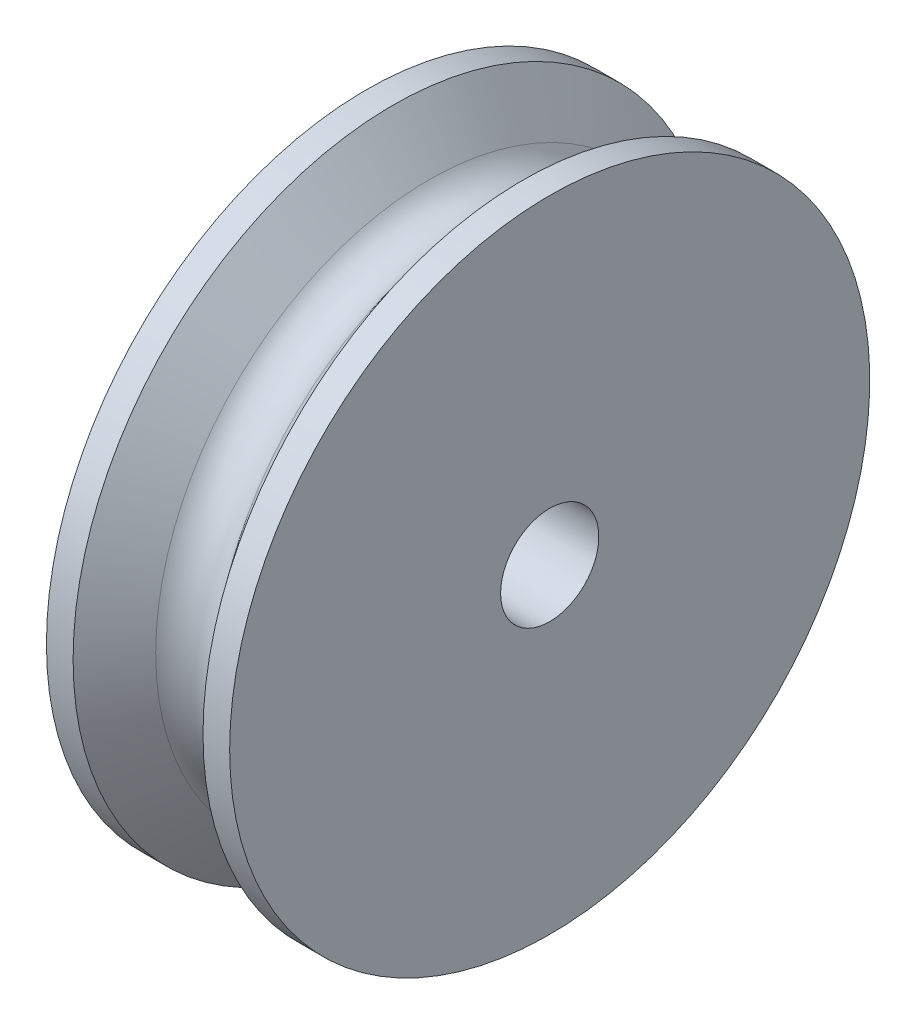
ISO-10303-21;
HEADER;
FILE_DESCRIPTION(('STEP AP214'),'2;1');
FILE_NAME('part.step','',(''),(''),'','','');
FILE_SCHEMA(('AUTOMOTIVE_DESIGN { 1 0 10303 214 1 1 1 1 }'));
ENDSEC;
DATA;
#1=APPLICATION_CONTEXT('core data for automotive mechanical design processes');
#2=APPLICATION_PROTOCOL_DEFINITION('international standard','automotive_design',2000,#1);
#3=PRODUCT_CONTEXT('',#1,'mechanical');
#4=PRODUCT('Part','Part','',(#3));
#5=PRODUCT_RELATED_PRODUCT_CATEGORY('part','',(#4));
#6=PRODUCT_DEFINITION_FORMATION('','',#4);
#7=PRODUCT_DEFINITION_CONTEXT('part definition',#1,'design');
#8=PRODUCT_DEFINITION('design','',#6,#7);
#9=PRODUCT_DEFINITION_SHAPE('','',#8);
#10=(LENGTH_UNIT() NAMED_UNIT(*) SI_UNIT(.MILLI.,.METRE.));
#11=(NAMED_UNIT(*) PLANE_ANGLE_UNIT() SI_UNIT($,.RADIAN.));
#12=(NAMED_UNIT(*) SI_UNIT($,.STERADIAN.) SOLID_ANGLE_UNIT());
#13=UNCERTAINTY_MEASURE_WITH_UNIT(LENGTH_MEASURE(1.E-05),#10,'distance_accuracy_value','');
#14=(GEOMETRIC_REPRESENTATION_CONTEXT(3) GLOBAL_UNCERTAINTY_ASSIGNED_CONTEXT((#13)) GLOBAL_UNIT_ASSIGNED_CONTEXT((#10,
#11,#12)) REPRESENTATION_CONTEXT('',''));
#15=CARTESIAN_POINT('',(0.,0.,0.));
#16=DIRECTION('',(0.,0.,1.));
#17=DIRECTION('',(1.,0.,0.));
#18=AXIS2_PLACEMENT_3D('',#15,#16,#17);
#19=CARTESIAN_POINT('',(0.,16.637,0.));
#20=DIRECTION('',(1.,0.,0.));
#21=DIRECTION('',(0.,0.,-1.));
#22=AXIS2_PLACEMENT_3D('',#19,#20,#21);
#23=PLANE('',#22);
#24=CARTESIAN_POINT('',(0.,0.,0.));
#25=DIRECTION('',(-1.,0.,0.));
#26=DIRECTION('',(0.,0.,1.));
#27=AXIS2_PLACEMENT_3D('',#24,#25,#26);
#28=CIRCLE('',#27,2.5527);
#29=CARTESIAN_POINT('',(0.,0.,2.5527));
#30=VERTEX_POINT('',#29);
#31=EDGE_CURVE('E78',#30,#30,#28,.T.);
#32=ORIENTED_EDGE('',*,*,#31,.F.);
#33=EDGE_LOOP('',(#32));
#34=FACE_BOUND('',#33,.T.);
#35=CARTESIAN_POINT('',(0.,0.,0.));
#36=DIRECTION('',(-1.,0.,0.));
#37=DIRECTION('',(0.,0.,1.));
#38=AXIS2_PLACEMENT_3D('',#35,#36,#37);
#39=CIRCLE('',#38,16.637);
#40=CARTESIAN_POINT('',(0.,0.,16.637));
#41=VERTEX_POINT('',#40);
#42=EDGE_CURVE('E10',#41,#41,#39,.T.);
#43=ORIENTED_EDGE('',*,*,#42,.T.);
#44=EDGE_LOOP('',(#43));
#45=FACE_BOUND('',#44,.T.);
#46=ADVANCED_FACE('F43',(#34,#45),#23,.F.);
#47=CARTESIAN_POINT('',(0.,0.,0.));
#48=DIRECTION('',(-1.,0.,0.));
#49=DIRECTION('',(0.,0.,1.));
#50=AXIS2_PLACEMENT_3D('',#47,#48,#49);
#51=CYLINDRICAL_SURFACE('',#50,16.637);
#52=ORIENTED_EDGE('',*,*,#42,.F.);
#53=EDGE_LOOP('',(#52));
#54=FACE_BOUND('',#53,.T.);
#55=CARTESIAN_POINT('',(1.38679477657717,0.,0.));
#56=DIRECTION('',(-1.,0.,0.));
#57=DIRECTION('',(0.,0.,1.));
#58=AXIS2_PLACEMENT_3D('',#55,#56,#57);
#59=CIRCLE('',#58,16.637);
#60=CARTESIAN_POINT('',(1.38679477657717,0.,16.637));
#61=VERTEX_POINT('',#60);
#62=EDGE_CURVE('E50',#61,#61,#59,.T.);
#63=ORIENTED_EDGE('',*,*,#62,.T.);
#64=EDGE_LOOP('',(#63));
#65=FACE_BOUND('',#64,.T.);
#66=ADVANCED_FACE('F86',(#54,#65),#51,.T.);
#67=CARTESIAN_POINT('',(3.25116188674519,0.,0.));
#68=DIRECTION('',(-1.,0.,0.));
#69=DIRECTION('',(0.,0.,1.));
#70=AXIS2_PLACEMENT_3D('',#67,#68,#69);
#71=CONICAL_SURFACE('',#70,14.2073094777384,0.916297857297025);
#72=ORIENTED_EDGE('',*,*,#62,.F.);
#73=EDGE_LOOP('',(#72));
#74=FACE_BOUND('',#73,.T.);
#75=CARTESIAN_POINT('',(3.25116188674519,0.,0.));
#76=DIRECTION('',(-1.,0.,0.));
#77=DIRECTION('',(0.,0.,1.));
#78=AXIS2_PLACEMENT_3D('',#75,#76,#77);
#79=CIRCLE('',#78,14.2073094777384);
#80=CARTESIAN_POINT('',(3.25116188674519,0.,14.2073094777384));
#81=VERTEX_POINT('',#80);
#82=EDGE_CURVE('E56',#81,#81,#79,.T.);
#83=ORIENTED_EDGE('',*,*,#82,.T.);
#84=EDGE_LOOP('',(#83));
#85=FACE_BOUND('',#84,.T.);
#86=ADVANCED_FACE('F90',(#74,#85),#71,.T.);
#87=CARTESIAN_POINT('',(4.7625,0.,0.));
#88=DIRECTION('',(-1.,0.,0.));
#89=DIRECTION('',(0.,0.,1.));
#90=AXIS2_PLACEMENT_3D('',#87,#88,#89);
#91=TOROIDAL_SURFACE('',#90,15.367,1.905);
#92=ORIENTED_EDGE('',*,*,#82,.F.);
#93=EDGE_LOOP('',(#92));
#94=FACE_BOUND('',#93,.T.);
#95=CARTESIAN_POINT('',(6.2738381132548,0.,0.));
#96=DIRECTION('',(-1.,0.,0.));
#97=DIRECTION('',(0.,0.,1.));
#98=AXIS2_PLACEMENT_3D('',#95,#96,#97);
#99=CIRCLE('',#98,14.2073094777384);
#100=CARTESIAN_POINT('',(6.2738381132548,0.,14.2073094777384));
#101=VERTEX_POINT('',#100);
#102=EDGE_CURVE('E61',#101,#101,#99,.T.);
#103=ORIENTED_EDGE('',*,*,#102,.T.);
#104=EDGE_LOOP('',(#103));
#105=FACE_BOUND('',#104,.T.);
#106=ADVANCED_FACE('F94',(#94,#105),#91,.F.);
#107=CARTESIAN_POINT('',(8.13820522342282,0.,0.));
#108=DIRECTION('',(1.,0.,0.));
#109=DIRECTION('',(0.,0.,-1.));
#110=AXIS2_PLACEMENT_3D('',#107,#108,#109);
#111=CONICAL_SURFACE('',#110,16.637,0.916297857297025);
#112=ORIENTED_EDGE('',*,*,#102,.F.);
#113=EDGE_LOOP('',(#112));
#114=FACE_BOUND('',#113,.T.);
#115=CARTESIAN_POINT('',(8.13820522342282,0.,0.));
#116=DIRECTION('',(-1.,0.,0.));
#117=DIRECTION('',(0.,0.,1.));
#118=AXIS2_PLACEMENT_3D('',#115,#116,#117);
#119=CIRCLE('',#118,16.637);
#120=CARTESIAN_POINT('',(8.13820522342282,0.,16.637));
#121=VERTEX_POINT('',#120);
#122=EDGE_CURVE('E66',#121,#121,#119,.T.);
#123=ORIENTED_EDGE('',*,*,#122,.T.);
#124=EDGE_LOOP('',(#123));
#125=FACE_BOUND('',#124,.T.);
#126=ADVANCED_FACE('F100',(#114,#125),#111,.T.);
#127=CARTESIAN_POINT('',(0.,0.,0.));
#128=DIRECTION('',(-1.,0.,0.));
#129=DIRECTION('',(0.,0.,1.));
#130=AXIS2_PLACEMENT_3D('',#127,#128,#129);
#131=CYLINDRICAL_SURFACE('',#130,16.637);
#132=ORIENTED_EDGE('',*,*,#122,.F.);
#133=EDGE_LOOP('',(#132));
#134=FACE_BOUND('',#133,.T.);
#135=CARTESIAN_POINT('',(9.525,0.,0.));
#136=DIRECTION('',(-1.,0.,0.));
#137=DIRECTION('',(0.,0.,1.));
#138=AXIS2_PLACEMENT_3D('',#135,#136,#137);
#139=CIRCLE('',#138,16.637);
#140=CARTESIAN_POINT('',(9.525,0.,16.637));
#141=VERTEX_POINT('',#140);
#142=EDGE_CURVE('E70',#141,#141,#139,.T.);
#143=ORIENTED_EDGE('',*,*,#142,.T.);
#144=EDGE_LOOP('',(#143));
#145=FACE_BOUND('',#144,.T.);
#146=ADVANCED_FACE('F103',(#134,#145),#131,.T.);
#147=CARTESIAN_POINT('',(9.525,2.5527,0.));
#148=DIRECTION('',(-1.,0.,0.));
#149=DIRECTION('',(0.,0.,1.));
#150=AXIS2_PLACEMENT_3D('',#147,#148,#149);
#151=PLANE('',#150);
#152=ORIENTED_EDGE('',*,*,#142,.F.);
#153=EDGE_LOOP('',(#152));
#154=FACE_BOUND('',#153,.T.);
#155=CARTESIAN_POINT('',(9.525,0.,0.));
#156=DIRECTION('',(-1.,0.,0.));
#157=DIRECTION('',(0.,0.,1.));
#158=AXIS2_PLACEMENT_3D('',#155,#156,#157);
#159=CIRCLE('',#158,2.5527);
#160=CARTESIAN_POINT('',(9.525,0.,2.5527));
#161=VERTEX_POINT('',#160);
#162=EDGE_CURVE('E74',#161,#161,#159,.T.);
#163=ORIENTED_EDGE('',*,*,#162,.T.);
#164=EDGE_LOOP('',(#163));
#165=FACE_BOUND('',#164,.T.);
#166=ADVANCED_FACE('F107',(#154,#165),#151,.F.);
#167=CARTESIAN_POINT('',(0.,0.,0.));
#168=DIRECTION('',(-1.,0.,0.));
#169=DIRECTION('',(0.,0.,1.));
#170=AXIS2_PLACEMENT_3D('',#167,#168,#169);
#171=CYLINDRICAL_SURFACE('',#170,2.5527);
#172=ORIENTED_EDGE('',*,*,#162,.F.);
#173=EDGE_LOOP('',(#172));
#174=FACE_BOUND('',#173,.T.);
#175=ORIENTED_EDGE('',*,*,#31,.T.);
#176=EDGE_LOOP('',(#175));
#177=FACE_BOUND('',#176,.T.);
#178=ADVANCED_FACE('F83',(#174,#177),#171,.F.);
#179=CLOSED_SHELL('',(#46,#66,#86,#106,#126,#146,#166,#178));
#180=MANIFOLD_SOLID_BREP('B2',#179);
#181=ADVANCED_BREP_SHAPE_REPRESENTATION('',(#18,#180),#14);
#182=SHAPE_DEFINITION_REPRESENTATION(#9,#181);
ENDSEC;
END-ISO-10303-21;
